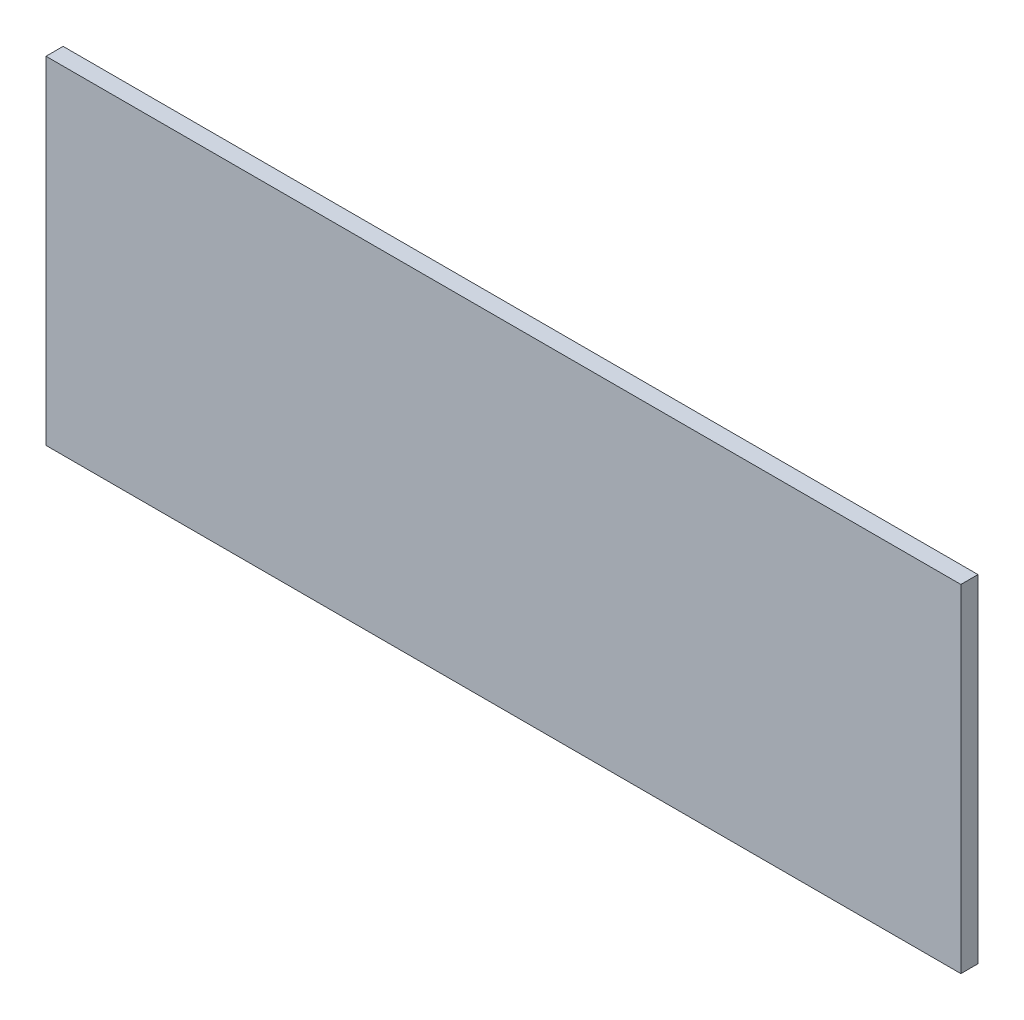
ISO-10303-21;
HEADER;
FILE_DESCRIPTION(('STEP AP214'),'2;1');
FILE_NAME('part.step','',(''),(''),'','','');
FILE_SCHEMA(('AUTOMOTIVE_DESIGN { 1 0 10303 214 1 1 1 1 }'));
ENDSEC;
DATA;
#1=APPLICATION_CONTEXT('core data for automotive mechanical design processes');
#2=APPLICATION_PROTOCOL_DEFINITION('international standard','automotive_design',2000,#1);
#3=PRODUCT_CONTEXT('',#1,'mechanical');
#4=PRODUCT('Part','Part','',(#3));
#5=PRODUCT_RELATED_PRODUCT_CATEGORY('part','',(#4));
#6=PRODUCT_DEFINITION_FORMATION('','',#4);
#7=PRODUCT_DEFINITION_CONTEXT('part definition',#1,'design');
#8=PRODUCT_DEFINITION('design','',#6,#7);
#9=PRODUCT_DEFINITION_SHAPE('','',#8);
#10=(LENGTH_UNIT() NAMED_UNIT(*) SI_UNIT(.MILLI.,.METRE.));
#11=(NAMED_UNIT(*) PLANE_ANGLE_UNIT() SI_UNIT($,.RADIAN.));
#12=(NAMED_UNIT(*) SI_UNIT($,.STERADIAN.) SOLID_ANGLE_UNIT());
#13=UNCERTAINTY_MEASURE_WITH_UNIT(LENGTH_MEASURE(1.E-05),#10,'distance_accuracy_value','');
#14=(GEOMETRIC_REPRESENTATION_CONTEXT(3) GLOBAL_UNCERTAINTY_ASSIGNED_CONTEXT((#13)) GLOBAL_UNIT_ASSIGNED_CONTEXT((#10,
#11,#12)) REPRESENTATION_CONTEXT('',''));
#15=CARTESIAN_POINT('',(0.,0.,0.));
#16=DIRECTION('',(0.,0.,1.));
#17=DIRECTION('',(1.,0.,0.));
#18=AXIS2_PLACEMENT_3D('',#15,#16,#17);
#19=CARTESIAN_POINT('',(96.5670013427734,65.0869979858398,0.));
#20=DIRECTION('',(0.,1.,0.));
#21=DIRECTION('',(1.,0.,0.));
#22=AXIS2_PLACEMENT_3D('',#19,#20,#21);
#23=PLANE('',#22);
#24=DIRECTION('',(1.,0.,0.));
#25=VECTOR('',#24,1.);
#26=CARTESIAN_POINT('',(96.5670013427734,65.0869979858398,0.03556));
#27=LINE('',#26,#25);
#28=CARTESIAN_POINT('',(96.5670013427734,65.0869979858398,0.03556));
#29=VERTEX_POINT('',#28);
#30=CARTESIAN_POINT('',(98.4670028686523,65.0869979858398,0.03556));
#31=VERTEX_POINT('',#30);
#32=EDGE_CURVE('E11',#29,#31,#27,.T.);
#33=ORIENTED_EDGE('',*,*,#32,.F.);
#34=DIRECTION('',(0.,0.,1.));
#35=VECTOR('',#34,1.);
#36=CARTESIAN_POINT('',(96.5670013427734,65.0869979858398,0.));
#37=LINE('',#36,#35);
#38=CARTESIAN_POINT('',(96.5670013427734,65.0869979858398,0.));
#39=VERTEX_POINT('',#38);
#40=EDGE_CURVE('E24',#39,#29,#37,.T.);
#41=ORIENTED_EDGE('',*,*,#40,.F.);
#42=DIRECTION('',(1.,0.,0.));
#43=VECTOR('',#42,1.);
#44=CARTESIAN_POINT('',(96.5670013427734,65.0869979858398,0.));
#45=LINE('',#44,#43);
#46=CARTESIAN_POINT('',(98.4670028686523,65.0869979858398,0.));
#47=VERTEX_POINT('',#46);
#48=EDGE_CURVE('E75',#39,#47,#45,.T.);
#49=ORIENTED_EDGE('',*,*,#48,.T.);
#50=DIRECTION('',(0.,0.,1.));
#51=VECTOR('',#50,1.);
#52=CARTESIAN_POINT('',(98.4670028686523,65.0869979858398,0.));
#53=LINE('',#52,#51);
#54=EDGE_CURVE('E37',#47,#31,#53,.T.);
#55=ORIENTED_EDGE('',*,*,#54,.T.);
#56=EDGE_LOOP('',(#33,#41,#49,#55));
#57=FACE_BOUND('',#56,.T.);
#58=ADVANCED_FACE('F17',(#57),#23,.F.);
#59=CARTESIAN_POINT('',(98.4670028686523,65.0869979858398,0.));
#60=DIRECTION('',(-1.,0.,0.));
#61=DIRECTION('',(0.,1.,0.));
#62=AXIS2_PLACEMENT_3D('',#59,#60,#61);
#63=PLANE('',#62);
#64=DIRECTION('',(0.,1.,0.));
#65=VECTOR('',#64,1.);
#66=CARTESIAN_POINT('',(98.4670028686523,65.0869979858398,0.03556));
#67=LINE('',#66,#65);
#68=CARTESIAN_POINT('',(98.4670028686523,65.7870025634766,0.03556));
#69=VERTEX_POINT('',#68);
#70=EDGE_CURVE('E83',#31,#69,#67,.T.);
#71=ORIENTED_EDGE('',*,*,#70,.F.);
#72=ORIENTED_EDGE('',*,*,#54,.F.);
#73=DIRECTION('',(0.,1.,0.));
#74=VECTOR('',#73,1.);
#75=CARTESIAN_POINT('',(98.4670028686523,65.0869979858398,0.));
#76=LINE('',#75,#74);
#77=CARTESIAN_POINT('',(98.4670028686523,65.7870025634766,0.));
#78=VERTEX_POINT('',#77);
#79=EDGE_CURVE('E81',#47,#78,#76,.T.);
#80=ORIENTED_EDGE('',*,*,#79,.T.);
#81=DIRECTION('',(0.,0.,1.));
#82=VECTOR('',#81,1.);
#83=CARTESIAN_POINT('',(98.4670028686523,65.7870025634766,0.));
#84=LINE('',#83,#82);
#85=EDGE_CURVE('E67',#78,#69,#84,.T.);
#86=ORIENTED_EDGE('',*,*,#85,.T.);
#87=EDGE_LOOP('',(#71,#72,#80,#86));
#88=FACE_BOUND('',#87,.T.);
#89=ADVANCED_FACE('F89',(#88),#63,.F.);
#90=CARTESIAN_POINT('',(98.4670028686523,65.7870025634766,0.));
#91=DIRECTION('',(0.,-1.,0.));
#92=DIRECTION('',(-1.,0.,0.));
#93=AXIS2_PLACEMENT_3D('',#90,#91,#92);
#94=PLANE('',#93);
#95=DIRECTION('',(-1.,0.,0.));
#96=VECTOR('',#95,1.);
#97=CARTESIAN_POINT('',(98.4670028686523,65.7870025634766,0.03556));
#98=LINE('',#97,#96);
#99=CARTESIAN_POINT('',(96.5670013427734,65.7870025634766,0.03556));
#100=VERTEX_POINT('',#99);
#101=EDGE_CURVE('E71',#69,#100,#98,.T.);
#102=ORIENTED_EDGE('',*,*,#101,.F.);
#103=ORIENTED_EDGE('',*,*,#85,.F.);
#104=DIRECTION('',(-1.,0.,0.));
#105=VECTOR('',#104,1.);
#106=CARTESIAN_POINT('',(98.4670028686523,65.7870025634766,0.));
#107=LINE('',#106,#105);
#108=CARTESIAN_POINT('',(96.5670013427734,65.7870025634766,0.));
#109=VERTEX_POINT('',#108);
#110=EDGE_CURVE('E63',#78,#109,#107,.T.);
#111=ORIENTED_EDGE('',*,*,#110,.T.);
#112=DIRECTION('',(0.,0.,1.));
#113=VECTOR('',#112,1.);
#114=CARTESIAN_POINT('',(96.5670013427734,65.7870025634766,0.));
#115=LINE('',#114,#113);
#116=EDGE_CURVE('E53',#109,#100,#115,.T.);
#117=ORIENTED_EDGE('',*,*,#116,.T.);
#118=EDGE_LOOP('',(#102,#103,#111,#117));
#119=FACE_BOUND('',#118,.T.);
#120=ADVANCED_FACE('F66',(#119),#94,.F.);
#121=CARTESIAN_POINT('',(96.5670013427734,65.7870025634766,0.));
#122=DIRECTION('',(1.,0.,0.));
#123=DIRECTION('',(0.,-1.,0.));
#124=AXIS2_PLACEMENT_3D('',#121,#122,#123);
#125=PLANE('',#124);
#126=DIRECTION('',(0.,-1.,0.));
#127=VECTOR('',#126,1.);
#128=CARTESIAN_POINT('',(96.5670013427734,65.7870025634766,0.03556));
#129=LINE('',#128,#127);
#130=EDGE_CURVE('E59',#100,#29,#129,.T.);
#131=ORIENTED_EDGE('',*,*,#130,.F.);
#132=ORIENTED_EDGE('',*,*,#116,.F.);
#133=DIRECTION('',(0.,-1.,0.));
#134=VECTOR('',#133,1.);
#135=CARTESIAN_POINT('',(96.5670013427734,65.7870025634766,0.));
#136=LINE('',#135,#134);
#137=EDGE_CURVE('E57',#109,#39,#136,.T.);
#138=ORIENTED_EDGE('',*,*,#137,.T.);
#139=ORIENTED_EDGE('',*,*,#40,.T.);
#140=EDGE_LOOP('',(#131,#132,#138,#139));
#141=FACE_BOUND('',#140,.T.);
#142=ADVANCED_FACE('F55',(#141),#125,.F.);
#143=CARTESIAN_POINT('',(96.5670013427734,65.0869979858398,0.));
#144=DIRECTION('',(0.,0.,-1.));
#145=DIRECTION('',(-1.,0.,0.));
#146=AXIS2_PLACEMENT_3D('',#143,#144,#145);
#147=PLANE('',#146);
#148=ORIENTED_EDGE('',*,*,#137,.F.);
#149=ORIENTED_EDGE('',*,*,#110,.F.);
#150=ORIENTED_EDGE('',*,*,#79,.F.);
#151=ORIENTED_EDGE('',*,*,#48,.F.);
#152=EDGE_LOOP('',(#148,#149,#150,#151));
#153=FACE_BOUND('',#152,.T.);
#154=ADVANCED_FACE('F74',(#153),#147,.T.);
#155=CARTESIAN_POINT('',(96.5670013427734,65.0869979858398,0.03556));
#156=DIRECTION('',(0.,0.,-1.));
#157=DIRECTION('',(-1.,0.,0.));
#158=AXIS2_PLACEMENT_3D('',#155,#156,#157);
#159=PLANE('',#158);
#160=ORIENTED_EDGE('',*,*,#32,.T.);
#161=ORIENTED_EDGE('',*,*,#70,.T.);
#162=ORIENTED_EDGE('',*,*,#101,.T.);
#163=ORIENTED_EDGE('',*,*,#130,.T.);
#164=EDGE_LOOP('',(#160,#161,#162,#163));
#165=FACE_BOUND('',#164,.T.);
#166=ADVANCED_FACE('F91',(#165),#159,.F.);
#167=CLOSED_SHELL('',(#58,#89,#120,#142,#154,#166));
#168=MANIFOLD_SOLID_BREP('B1',#167);
#169=ADVANCED_BREP_SHAPE_REPRESENTATION('',(#18,#168),#14);
#170=SHAPE_DEFINITION_REPRESENTATION(#9,#169);
ENDSEC;
END-ISO-10303-21;
